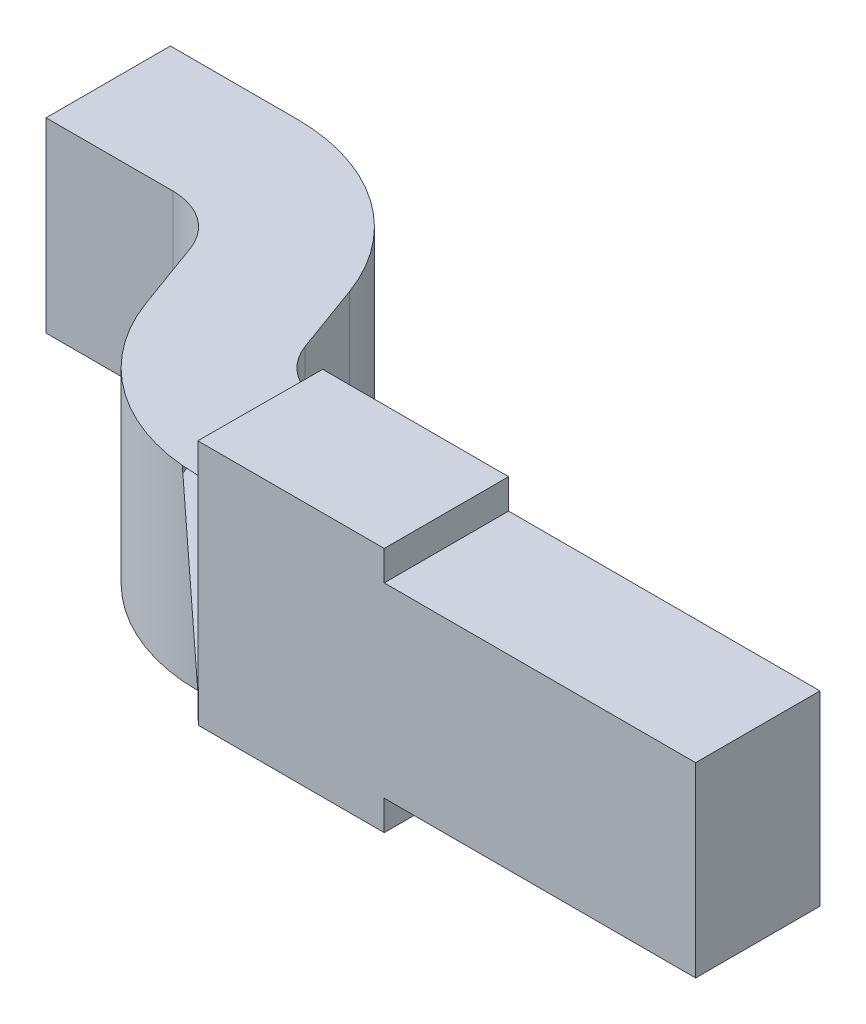
ISO-10303-21;
HEADER;
FILE_DESCRIPTION(('STEP AP214'),'2;1');
FILE_NAME('part.step','',(''),(''),'','','');
FILE_SCHEMA(('AUTOMOTIVE_DESIGN { 1 0 10303 214 1 1 1 1 }'));
ENDSEC;
DATA;
#1=APPLICATION_CONTEXT('core data for automotive mechanical design processes');
#2=APPLICATION_PROTOCOL_DEFINITION('international standard','automotive_design',2000,#1);
#3=PRODUCT_CONTEXT('',#1,'mechanical');
#4=PRODUCT('Part','Part','',(#3));
#5=PRODUCT_RELATED_PRODUCT_CATEGORY('part','',(#4));
#6=PRODUCT_DEFINITION_FORMATION('','',#4);
#7=PRODUCT_DEFINITION_CONTEXT('part definition',#1,'design');
#8=PRODUCT_DEFINITION('design','',#6,#7);
#9=PRODUCT_DEFINITION_SHAPE('','',#8);
#10=(LENGTH_UNIT() NAMED_UNIT(*) SI_UNIT(.MILLI.,.METRE.));
#11=(NAMED_UNIT(*) PLANE_ANGLE_UNIT() SI_UNIT($,.RADIAN.));
#12=(NAMED_UNIT(*) SI_UNIT($,.STERADIAN.) SOLID_ANGLE_UNIT());
#13=UNCERTAINTY_MEASURE_WITH_UNIT(LENGTH_MEASURE(1.E-05),#10,'distance_accuracy_value','');
#14=(GEOMETRIC_REPRESENTATION_CONTEXT(3) GLOBAL_UNCERTAINTY_ASSIGNED_CONTEXT((#13)) GLOBAL_UNIT_ASSIGNED_CONTEXT((#10,
#11,#12)) REPRESENTATION_CONTEXT('',''));
#15=CARTESIAN_POINT('',(0.,0.,0.));
#16=DIRECTION('',(0.,0.,1.));
#17=DIRECTION('',(1.,0.,0.));
#18=AXIS2_PLACEMENT_3D('',#15,#16,#17);
#19=CARTESIAN_POINT('',(195.3553175894,98.8770432923502,113.086328634145));
#20=DIRECTION('',(0.,1.,0.));
#21=DIRECTION('',(1.,0.,0.));
#22=AXIS2_PLACEMENT_3D('',#19,#20,#21);
#23=PLANE('',#22);
#24=DIRECTION('',(-1.,0.,0.));
#25=VECTOR('',#24,1.);
#26=CARTESIAN_POINT('',(197.209042943722,98.8770432923502,113.151470551509));
#27=LINE('',#26,#25);
#28=CARTESIAN_POINT('',(197.209042943722,98.8770432923502,113.151470551509));
#29=VERTEX_POINT('',#28);
#30=CARTESIAN_POINT('',(195.956744279938,98.8770432923502,113.151470551509));
#31=VERTEX_POINT('',#30);
#32=EDGE_CURVE('E67',#29,#31,#27,.T.);
#33=ORIENTED_EDGE('',*,*,#32,.F.);
#34=DIRECTION('',(0.,0.,-1.));
#35=VECTOR('',#34,1.);
#36=CARTESIAN_POINT('',(197.209042943722,98.8770432923502,113.651470551509));
#37=LINE('',#36,#35);
#38=CARTESIAN_POINT('',(197.209042943722,98.8770432923502,113.651470551509));
#39=VERTEX_POINT('',#38);
#40=EDGE_CURVE('E348',#39,#29,#37,.T.);
#41=ORIENTED_EDGE('',*,*,#40,.F.);
#42=DIRECTION('',(1.,0.,0.));
#43=VECTOR('',#42,1.);
#44=CARTESIAN_POINT('',(195.209042943722,98.8770432923502,113.651470551509));
#45=LINE('',#44,#43);
#46=CARTESIAN_POINT('',(195.956744279938,98.8770432923502,113.651470551509));
#47=VERTEX_POINT('',#46);
#48=EDGE_CURVE('E333',#47,#39,#45,.T.);
#49=ORIENTED_EDGE('',*,*,#48,.F.);
#50=DIRECTION('',(0.,0.,-1.));
#51=VECTOR('',#50,1.);
#52=CARTESIAN_POINT('',(195.956744279938,98.8770432923502,112.648955771372));
#53=LINE('',#52,#51);
#54=EDGE_CURVE('E11',#47,#31,#53,.T.);
#55=ORIENTED_EDGE('',*,*,#54,.T.);
#56=EDGE_LOOP('',(#33,#41,#49,#55));
#57=FACE_BOUND('',#56,.T.);
#58=ADVANCED_FACE('F44',(#57),#23,.F.);
#59=CARTESIAN_POINT('',(195.956744279938,104.78204329235,112.211582908599));
#60=DIRECTION('',(1.,0.,0.));
#61=DIRECTION('',(0.,1.,0.));
#62=AXIS2_PLACEMENT_3D('',#59,#60,#61);
#63=PLANE('',#62);
#64=ORIENTED_EDGE('',*,*,#54,.F.);
#65=DIRECTION('',(0.,1.,0.));
#66=VECTOR('',#65,1.);
#67=CARTESIAN_POINT('',(195.956744279938,102.26454329235,113.651470551509));
#68=LINE('',#67,#66);
#69=CARTESIAN_POINT('',(195.956744279938,98.7570432923502,113.651470551509));
#70=VERTEX_POINT('',#69);
#71=EDGE_CURVE('E218',#70,#47,#68,.T.);
#72=ORIENTED_EDGE('',*,*,#71,.F.);
#73=DIRECTION('',(0.,0.,-1.));
#74=VECTOR('',#73,1.);
#75=CARTESIAN_POINT('',(195.956744279938,98.7570432923502,112.648955771372));
#76=LINE('',#75,#74);
#77=CARTESIAN_POINT('',(195.956744279938,98.7570432923502,113.151470551509));
#78=VERTEX_POINT('',#77);
#79=EDGE_CURVE('E55',#70,#78,#76,.T.);
#80=ORIENTED_EDGE('',*,*,#79,.T.);
#81=DIRECTION('',(0.,-1.,0.));
#82=VECTOR('',#81,1.);
#83=CARTESIAN_POINT('',(195.956744279938,102.26454329235,113.151470551509));
#84=LINE('',#83,#82);
#85=EDGE_CURVE('E202',#31,#78,#84,.T.);
#86=ORIENTED_EDGE('',*,*,#85,.F.);
#87=EDGE_LOOP('',(#64,#72,#80,#86));
#88=FACE_BOUND('',#87,.T.);
#89=ADVANCED_FACE('F216',(#88),#63,.T.);
#90=CARTESIAN_POINT('',(195.3553175894,98.7570432923502,113.086328634145));
#91=DIRECTION('',(0.,1.,0.));
#92=DIRECTION('',(1.,0.,0.));
#93=AXIS2_PLACEMENT_3D('',#90,#91,#92);
#94=PLANE('',#93);
#95=DIRECTION('',(-1.,0.,0.));
#96=VECTOR('',#95,1.);
#97=CARTESIAN_POINT('',(197.209042943722,98.7570432923502,113.151470551509));
#98=LINE('',#97,#96);
#99=CARTESIAN_POINT('',(195.209042943722,98.7570432923502,113.151470551509));
#100=VERTEX_POINT('',#99);
#101=EDGE_CURVE('E208',#78,#100,#98,.T.);
#102=ORIENTED_EDGE('',*,*,#101,.F.);
#103=ORIENTED_EDGE('',*,*,#79,.F.);
#104=DIRECTION('',(1.,0.,0.));
#105=VECTOR('',#104,1.);
#106=CARTESIAN_POINT('',(195.209042943722,98.7570432923502,113.651470551509));
#107=LINE('',#106,#105);
#108=CARTESIAN_POINT('',(195.209042943722,98.7570432923502,113.651470551509));
#109=VERTEX_POINT('',#108);
#110=EDGE_CURVE('E405',#109,#70,#107,.T.);
#111=ORIENTED_EDGE('',*,*,#110,.F.);
#112=DIRECTION('',(0.,0.,1.));
#113=VECTOR('',#112,1.);
#114=CARTESIAN_POINT('',(195.206744279938,98.7570432923502,112.648955771372));
#115=LINE('',#114,#113);
#116=EDGE_CURVE('E222',#100,#109,#115,.T.);
#117=ORIENTED_EDGE('',*,*,#116,.F.);
#118=EDGE_LOOP('',(#102,#103,#111,#117));
#119=FACE_BOUND('',#118,.T.);
#120=ADVANCED_FACE('F224',(#119),#94,.F.);
#121=CARTESIAN_POINT('',(195.206744279938,98.2820432923502,112.211582908599));
#122=DIRECTION('',(-1.,0.,0.));
#123=DIRECTION('',(0.,0.,1.));
#124=AXIS2_PLACEMENT_3D('',#121,#122,#123);
#125=PLANE('',#124);
#126=DIRECTION('',(0.,1.,0.));
#127=VECTOR('',#126,1.);
#128=CARTESIAN_POINT('',(195.206744279938,99.7470432923502,113.151459983575));
#129=LINE('',#128,#127);
#130=CARTESIAN_POINT('',(195.206744279938,98.8770432923502,113.151459983575));
#131=VERTEX_POINT('',#130);
#132=EDGE_CURVE('E234',#100,#131,#129,.T.);
#133=ORIENTED_EDGE('',*,*,#132,.F.);
#134=ORIENTED_EDGE('',*,*,#116,.T.);
#135=DIRECTION('',(0.,1.,0.));
#136=VECTOR('',#135,1.);
#137=CARTESIAN_POINT('',(195.206744279938,99.7470432923502,113.651467028931));
#138=LINE('',#137,#136);
#139=CARTESIAN_POINT('',(195.206744279938,98.8770432923502,113.651467028931));
#140=VERTEX_POINT('',#139);
#141=EDGE_CURVE('E388',#109,#140,#138,.T.);
#142=ORIENTED_EDGE('',*,*,#141,.T.);
#143=DIRECTION('',(0.,0.,1.));
#144=VECTOR('',#143,1.);
#145=CARTESIAN_POINT('',(195.206744279938,98.8770432923502,112.648955771372));
#146=LINE('',#145,#144);
#147=EDGE_CURVE('E361',#131,#140,#146,.T.);
#148=ORIENTED_EDGE('',*,*,#147,.F.);
#149=EDGE_LOOP('',(#133,#134,#142,#148));
#150=FACE_BOUND('',#149,.T.);
#151=ADVANCED_FACE('F502',(#150),#125,.T.);
#152=CARTESIAN_POINT('',(195.3553175894,98.8770432923502,113.086328634145));
#153=DIRECTION('',(0.,1.,0.));
#154=DIRECTION('',(1.,0.,0.));
#155=AXIS2_PLACEMENT_3D('',#152,#153,#154);
#156=PLANE('',#155);
#157=DIRECTION('',(-1.,0.,0.));
#158=VECTOR('',#157,1.);
#159=CARTESIAN_POINT('',(194.166744279938,98.8770432923502,112.211582908599));
#160=LINE('',#159,#158);
#161=CARTESIAN_POINT('',(194.166744279938,98.8770432923502,112.211582908599));
#162=VERTEX_POINT('',#161);
#163=CARTESIAN_POINT('',(193.656744279938,98.8770432923502,112.211582908599));
#164=VERTEX_POINT('',#163);
#165=EDGE_CURVE('E308',#162,#164,#160,.T.);
#166=ORIENTED_EDGE('',*,*,#165,.F.);
#167=CARTESIAN_POINT('',(194.166744279938,98.8770432923502,112.961582908599));
#168=DIRECTION('',(0.,1.,0.));
#169=DIRECTION('',(0.939692620785816,0.,-0.342020143325922));
#170=AXIS2_PLACEMENT_3D('',#167,#168,#169);
#171=CIRCLE('',#170,0.75);
#172=CARTESIAN_POINT('',(194.871513745527,98.8770432923502,112.705067801105));
#173=VERTEX_POINT('',#172);
#174=EDGE_CURVE('E288',#173,#162,#171,.T.);
#175=ORIENTED_EDGE('',*,*,#174,.F.);
#176=DIRECTION('',(-0.342020143325932,0.,-0.939692620785813));
#177=VECTOR('',#176,1.);
#178=CARTESIAN_POINT('',(194.974119788525,98.8770432923502,112.986975587341));
#179=LINE('',#178,#177);
#180=CARTESIAN_POINT('',(194.974119788525,98.8770432923502,112.986975587341));
#181=VERTEX_POINT('',#180);
#182=EDGE_CURVE('E299',#181,#173,#179,.T.);
#183=ORIENTED_EDGE('',*,*,#182,.F.);
#184=CARTESIAN_POINT('',(195.209042943722,98.8770432923502,112.901470551509));
#185=DIRECTION('',(0.,-1.,0.));
#186=DIRECTION('',(0.,0.,1.));
#187=AXIS2_PLACEMENT_3D('',#184,#185,#186);
#188=CIRCLE('',#187,0.25);
#189=EDGE_CURVE('E270',#131,#181,#188,.T.);
#190=ORIENTED_EDGE('',*,*,#189,.F.);
#191=ORIENTED_EDGE('',*,*,#147,.T.);
#192=CARTESIAN_POINT('',(195.209042943722,98.8770432923502,112.901470551509));
#193=DIRECTION('',(0.,1.,0.));
#194=DIRECTION('',(-0.939692620785816,0.,0.342020143325922));
#195=AXIS2_PLACEMENT_3D('',#192,#193,#194);
#196=CIRCLE('',#195,0.75);
#197=CARTESIAN_POINT('',(194.504273478132,98.8770432923502,113.157985659003));
#198=VERTEX_POINT('',#197);
#199=EDGE_CURVE('E343',#198,#140,#196,.T.);
#200=ORIENTED_EDGE('',*,*,#199,.F.);
#201=DIRECTION('',(0.342020143325932,0.,0.939692620785813));
#202=VECTOR('',#201,1.);
#203=CARTESIAN_POINT('',(194.401667435134,98.8770432923502,112.876077872768));
#204=LINE('',#203,#202);
#205=CARTESIAN_POINT('',(194.401667435134,98.8770432923502,112.876077872768));
#206=VERTEX_POINT('',#205);
#207=EDGE_CURVE('E298',#206,#198,#204,.T.);
#208=ORIENTED_EDGE('',*,*,#207,.F.);
#209=CARTESIAN_POINT('',(194.166744279938,98.8770432923502,112.961582908599));
#210=DIRECTION('',(0.,-1.,0.));
#211=DIRECTION('',(0.,0.,-1.));
#212=AXIS2_PLACEMENT_3D('',#209,#210,#211);
#213=CIRCLE('',#212,0.25);
#214=CARTESIAN_POINT('',(194.166744279938,98.8770432923502,112.711582908599));
#215=VERTEX_POINT('',#214);
#216=EDGE_CURVE('E317',#215,#206,#213,.T.);
#217=ORIENTED_EDGE('',*,*,#216,.F.);
#218=DIRECTION('',(1.,0.,0.));
#219=VECTOR('',#218,1.);
#220=CARTESIAN_POINT('',(193.656744279938,98.8770432923502,112.711582908599));
#221=LINE('',#220,#219);
#222=CARTESIAN_POINT('',(193.656744279938,98.8770432923502,112.711582908599));
#223=VERTEX_POINT('',#222);
#224=EDGE_CURVE('E362',#223,#215,#221,.T.);
#225=ORIENTED_EDGE('',*,*,#224,.F.);
#226=DIRECTION('',(0.,0.,1.));
#227=VECTOR('',#226,1.);
#228=CARTESIAN_POINT('',(193.656744279938,98.8770432923502,112.211582908599));
#229=LINE('',#228,#227);
#230=EDGE_CURVE('E290',#164,#223,#229,.T.);
#231=ORIENTED_EDGE('',*,*,#230,.F.);
#232=EDGE_LOOP('',(#166,#175,#183,#190,#191,#200,#208,#217,#225,#231));
#233=FACE_BOUND('',#232,.T.);
#234=ADVANCED_FACE('F445',(#233),#156,.F.);
#235=CARTESIAN_POINT('',(193.656744279938,99.6270432923502,112.711582908599));
#236=DIRECTION('',(0.,0.,1.));
#237=DIRECTION('',(1.,0.,0.));
#238=AXIS2_PLACEMENT_3D('',#235,#236,#237);
#239=PLANE('',#238);
#240=DIRECTION('',(0.,-1.,0.));
#241=VECTOR('',#240,1.);
#242=CARTESIAN_POINT('',(193.656744279938,99.6270432923502,112.711582908599));
#243=LINE('',#242,#241);
#244=CARTESIAN_POINT('',(193.656744279938,99.6270432923502,112.711582908599));
#245=VERTEX_POINT('',#244);
#246=EDGE_CURVE('E357',#245,#223,#243,.T.);
#247=ORIENTED_EDGE('',*,*,#246,.T.);
#248=ORIENTED_EDGE('',*,*,#224,.T.);
#249=DIRECTION('',(0.,-1.,0.));
#250=VECTOR('',#249,1.);
#251=CARTESIAN_POINT('',(194.166744279938,99.6270432923502,112.711582908599));
#252=LINE('',#251,#250);
#253=CARTESIAN_POINT('',(194.166744279938,99.6270432923502,112.711582908599));
#254=VERTEX_POINT('',#253);
#255=EDGE_CURVE('E321',#254,#215,#252,.T.);
#256=ORIENTED_EDGE('',*,*,#255,.F.);
#257=DIRECTION('',(1.,0.,0.));
#258=VECTOR('',#257,1.);
#259=CARTESIAN_POINT('',(193.656744279938,99.6270432923502,112.711582908599));
#260=LINE('',#259,#258);
#261=EDGE_CURVE('E349',#245,#254,#260,.T.);
#262=ORIENTED_EDGE('',*,*,#261,.F.);
#263=EDGE_LOOP('',(#247,#248,#256,#262));
#264=FACE_BOUND('',#263,.T.);
#265=ADVANCED_FACE('F453',(#264),#239,.T.);
#266=CARTESIAN_POINT('',(194.166744279938,99.6270432923502,112.961582908599));
#267=DIRECTION('',(0.,1.,0.));
#268=DIRECTION('',(0.,0.,-1.));
#269=AXIS2_PLACEMENT_3D('',#266,#267,#268);
#270=CYLINDRICAL_SURFACE('',#269,0.25);
#271=ORIENTED_EDGE('',*,*,#255,.T.);
#272=ORIENTED_EDGE('',*,*,#216,.T.);
#273=DIRECTION('',(0.,-1.,0.));
#274=VECTOR('',#273,1.);
#275=CARTESIAN_POINT('',(194.401667435134,99.6270432923502,112.876077872768));
#276=LINE('',#275,#274);
#277=CARTESIAN_POINT('',(194.401667435134,99.6270432923502,112.876077872768));
#278=VERTEX_POINT('',#277);
#279=EDGE_CURVE('E322',#278,#206,#276,.T.);
#280=ORIENTED_EDGE('',*,*,#279,.F.);
#281=CARTESIAN_POINT('',(194.166744279938,99.6270432923502,112.961582908599));
#282=DIRECTION('',(0.,-1.,0.));
#283=DIRECTION('',(0.,0.,-1.));
#284=AXIS2_PLACEMENT_3D('',#281,#282,#283);
#285=CIRCLE('',#284,0.25);
#286=EDGE_CURVE('E356',#254,#278,#285,.T.);
#287=ORIENTED_EDGE('',*,*,#286,.F.);
#288=EDGE_LOOP('',(#271,#272,#280,#287));
#289=FACE_BOUND('',#288,.T.);
#290=ADVANCED_FACE('F448',(#289),#270,.F.);
#291=CARTESIAN_POINT('',(194.401667435134,99.6270432923502,112.876077872768));
#292=DIRECTION('',(-0.939692620785813,0.,0.342020143325932));
#293=DIRECTION('',(0.,1.,0.));
#294=AXIS2_PLACEMENT_3D('',#291,#292,#293);
#295=PLANE('',#294);
#296=ORIENTED_EDGE('',*,*,#279,.T.);
#297=ORIENTED_EDGE('',*,*,#207,.T.);
#298=DIRECTION('',(0.,-1.,0.));
#299=VECTOR('',#298,1.);
#300=CARTESIAN_POINT('',(194.504273478132,99.6270432923502,113.157985659003));
#301=LINE('',#300,#299);
#302=CARTESIAN_POINT('',(194.504273478132,99.6270432923502,113.157985659003));
#303=VERTEX_POINT('',#302);
#304=EDGE_CURVE('E256',#303,#198,#301,.T.);
#305=ORIENTED_EDGE('',*,*,#304,.F.);
#306=DIRECTION('',(0.342020143325932,0.,0.939692620785813));
#307=VECTOR('',#306,1.);
#308=CARTESIAN_POINT('',(194.401667435134,99.6270432923502,112.876077872768));
#309=LINE('',#308,#307);
#310=EDGE_CURVE('E338',#278,#303,#309,.T.);
#311=ORIENTED_EDGE('',*,*,#310,.F.);
#312=EDGE_LOOP('',(#296,#297,#305,#311));
#313=FACE_BOUND('',#312,.T.);
#314=ADVANCED_FACE('F442',(#313),#295,.T.);
#315=CARTESIAN_POINT('',(194.974119788525,99.6270432923502,112.986975587341));
#316=DIRECTION('',(0.939692620785813,0.,-0.342020143325932));
#317=DIRECTION('',(0.,-1.,0.));
#318=AXIS2_PLACEMENT_3D('',#315,#316,#317);
#319=PLANE('',#318);
#320=DIRECTION('',(0.,-1.,0.));
#321=VECTOR('',#320,1.);
#322=CARTESIAN_POINT('',(194.974119788525,99.6270432923502,112.986975587341));
#323=LINE('',#322,#321);
#324=CARTESIAN_POINT('',(194.974119788525,99.6270432923502,112.986975587341));
#325=VERTEX_POINT('',#324);
#326=EDGE_CURVE('E294',#325,#181,#323,.T.);
#327=ORIENTED_EDGE('',*,*,#326,.T.);
#328=ORIENTED_EDGE('',*,*,#182,.T.);
#329=DIRECTION('',(0.,-1.,0.));
#330=VECTOR('',#329,1.);
#331=CARTESIAN_POINT('',(194.871513745527,99.6270432923502,112.705067801105));
#332=LINE('',#331,#330);
#333=CARTESIAN_POINT('',(194.871513745527,99.6270432923502,112.705067801105));
#334=VERTEX_POINT('',#333);
#335=EDGE_CURVE('E326',#334,#173,#332,.T.);
#336=ORIENTED_EDGE('',*,*,#335,.F.);
#337=DIRECTION('',(-0.342020143325932,0.,-0.939692620785813));
#338=VECTOR('',#337,1.);
#339=CARTESIAN_POINT('',(194.974119788525,99.6270432923502,112.986975587341));
#340=LINE('',#339,#338);
#341=EDGE_CURVE('E303',#325,#334,#340,.T.);
#342=ORIENTED_EDGE('',*,*,#341,.F.);
#343=EDGE_LOOP('',(#327,#328,#336,#342));
#344=FACE_BOUND('',#343,.T.);
#345=ADVANCED_FACE('F505',(#344),#319,.T.);
#346=CARTESIAN_POINT('',(194.166744279938,99.6270432923502,112.961582908599));
#347=DIRECTION('',(0.,1.,0.));
#348=DIRECTION('',(0.939692620785816,0.,-0.342020143325922));
#349=AXIS2_PLACEMENT_3D('',#346,#347,#348);
#350=CYLINDRICAL_SURFACE('',#349,0.75);
#351=ORIENTED_EDGE('',*,*,#335,.T.);
#352=ORIENTED_EDGE('',*,*,#174,.T.);
#353=DIRECTION('',(0.,-1.,0.));
#354=VECTOR('',#353,1.);
#355=CARTESIAN_POINT('',(194.166744279938,99.6270432923502,112.211582908599));
#356=LINE('',#355,#354);
#357=CARTESIAN_POINT('',(194.166744279938,99.6270432923502,112.211582908599));
#358=VERTEX_POINT('',#357);
#359=EDGE_CURVE('E312',#358,#162,#356,.T.);
#360=ORIENTED_EDGE('',*,*,#359,.F.);
#361=CARTESIAN_POINT('',(194.166744279938,99.6270432923502,112.961582908599));
#362=DIRECTION('',(0.,1.,0.));
#363=DIRECTION('',(0.939692620785816,0.,-0.342020143325922));
#364=AXIS2_PLACEMENT_3D('',#361,#362,#363);
#365=CIRCLE('',#364,0.75);
#366=EDGE_CURVE('E300',#334,#358,#365,.T.);
#367=ORIENTED_EDGE('',*,*,#366,.F.);
#368=EDGE_LOOP('',(#351,#352,#360,#367));
#369=FACE_BOUND('',#368,.T.);
#370=ADVANCED_FACE('F506',(#369),#350,.T.);
#371=CARTESIAN_POINT('',(194.166744279938,99.6270432923502,112.211582908599));
#372=DIRECTION('',(0.,0.,-1.));
#373=DIRECTION('',(0.,-1.,0.));
#374=AXIS2_PLACEMENT_3D('',#371,#372,#373);
#375=PLANE('',#374);
#376=ORIENTED_EDGE('',*,*,#359,.T.);
#377=ORIENTED_EDGE('',*,*,#165,.T.);
#378=DIRECTION('',(0.,-1.,0.));
#379=VECTOR('',#378,1.);
#380=CARTESIAN_POINT('',(193.656744279938,99.6270432923502,112.211582908599));
#381=LINE('',#380,#379);
#382=CARTESIAN_POINT('',(193.656744279938,99.6270432923502,112.211582908599));
#383=VERTEX_POINT('',#382);
#384=EDGE_CURVE('E292',#383,#164,#381,.T.);
#385=ORIENTED_EDGE('',*,*,#384,.F.);
#386=DIRECTION('',(-1.,0.,0.));
#387=VECTOR('',#386,1.);
#388=CARTESIAN_POINT('',(194.166744279938,99.6270432923502,112.211582908599));
#389=LINE('',#388,#387);
#390=EDGE_CURVE('E304',#358,#383,#389,.T.);
#391=ORIENTED_EDGE('',*,*,#390,.F.);
#392=EDGE_LOOP('',(#376,#377,#385,#391));
#393=FACE_BOUND('',#392,.T.);
#394=ADVANCED_FACE('F467',(#393),#375,.T.);
#395=CARTESIAN_POINT('',(193.656744279938,99.6270432923502,112.211582908599));
#396=DIRECTION('',(-1.,0.,0.));
#397=DIRECTION('',(0.,1.,0.));
#398=AXIS2_PLACEMENT_3D('',#395,#396,#397);
#399=PLANE('',#398);
#400=ORIENTED_EDGE('',*,*,#384,.T.);
#401=ORIENTED_EDGE('',*,*,#230,.T.);
#402=ORIENTED_EDGE('',*,*,#246,.F.);
#403=DIRECTION('',(0.,0.,1.));
#404=VECTOR('',#403,1.);
#405=CARTESIAN_POINT('',(193.656744279938,99.6270432923502,112.211582908599));
#406=LINE('',#405,#404);
#407=EDGE_CURVE('E344',#383,#245,#406,.T.);
#408=ORIENTED_EDGE('',*,*,#407,.F.);
#409=EDGE_LOOP('',(#400,#401,#402,#408));
#410=FACE_BOUND('',#409,.T.);
#411=ADVANCED_FACE('F462',(#410),#399,.T.);
#412=CARTESIAN_POINT('',(197.209042943722,99.6270432923502,113.651470551509));
#413=DIRECTION('',(1.,0.,0.));
#414=DIRECTION('',(0.,1.,0.));
#415=AXIS2_PLACEMENT_3D('',#412,#413,#414);
#416=PLANE('',#415);
#417=DIRECTION('',(0.,-1.,0.));
#418=VECTOR('',#417,1.);
#419=CARTESIAN_POINT('',(197.209042943722,99.6270432923502,113.651470551509));
#420=LINE('',#419,#418);
#421=CARTESIAN_POINT('',(197.209042943722,99.6270432923502,113.651470551509));
#422=VERTEX_POINT('',#421);
#423=EDGE_CURVE('E293',#422,#39,#420,.T.);
#424=ORIENTED_EDGE('',*,*,#423,.T.);
#425=ORIENTED_EDGE('',*,*,#40,.T.);
#426=DIRECTION('',(0.,-1.,0.));
#427=VECTOR('',#426,1.);
#428=CARTESIAN_POINT('',(197.209042943722,99.6270432923502,113.151470551509));
#429=LINE('',#428,#427);
#430=CARTESIAN_POINT('',(197.209042943722,99.6270432923502,113.151470551509));
#431=VERTEX_POINT('',#430);
#432=EDGE_CURVE('E307',#431,#29,#429,.T.);
#433=ORIENTED_EDGE('',*,*,#432,.F.);
#434=DIRECTION('',(0.,0.,-1.));
#435=VECTOR('',#434,1.);
#436=CARTESIAN_POINT('',(197.209042943722,99.6270432923502,113.651470551509));
#437=LINE('',#436,#435);
#438=EDGE_CURVE('E478',#422,#431,#437,.T.);
#439=ORIENTED_EDGE('',*,*,#438,.F.);
#440=EDGE_LOOP('',(#424,#425,#433,#439));
#441=FACE_BOUND('',#440,.T.);
#442=ADVANCED_FACE('F546',(#441),#416,.T.);
#443=CARTESIAN_POINT('',(195.3553175894,99.6270432923502,113.086328634145));
#444=DIRECTION('',(0.,1.,0.));
#445=DIRECTION('',(1.,0.,0.));
#446=AXIS2_PLACEMENT_3D('',#443,#444,#445);
#447=PLANE('',#446);
#448=ORIENTED_EDGE('',*,*,#407,.T.);
#449=ORIENTED_EDGE('',*,*,#261,.T.);
#450=ORIENTED_EDGE('',*,*,#286,.T.);
#451=ORIENTED_EDGE('',*,*,#310,.T.);
#452=CARTESIAN_POINT('',(195.209042943722,99.6270432923502,112.901470551509));
#453=DIRECTION('',(0.,1.,0.));
#454=DIRECTION('',(-0.939692620785816,0.,0.342020143325922));
#455=AXIS2_PLACEMENT_3D('',#452,#453,#454);
#456=CIRCLE('',#455,0.75);
#457=CARTESIAN_POINT('',(195.206744279938,99.6270432923502,113.651467028931));
#458=VERTEX_POINT('',#457);
#459=EDGE_CURVE('E335',#303,#458,#456,.T.);
#460=ORIENTED_EDGE('',*,*,#459,.T.);
#461=DIRECTION('',(0.,0.,1.));
#462=VECTOR('',#461,1.);
#463=CARTESIAN_POINT('',(195.206744279938,99.6270432923502,112.648955771372));
#464=LINE('',#463,#462);
#465=CARTESIAN_POINT('',(195.206744279938,99.6270432923502,113.151459983575));
#466=VERTEX_POINT('',#465);
#467=EDGE_CURVE('E255',#466,#458,#464,.T.);
#468=ORIENTED_EDGE('',*,*,#467,.F.);
#469=CARTESIAN_POINT('',(195.209042943722,99.6270432923502,112.901470551509));
#470=DIRECTION('',(0.,-1.,0.));
#471=DIRECTION('',(0.,0.,1.));
#472=AXIS2_PLACEMENT_3D('',#469,#470,#471);
#473=CIRCLE('',#472,0.25);
#474=EDGE_CURVE('E339',#466,#325,#473,.T.);
#475=ORIENTED_EDGE('',*,*,#474,.T.);
#476=ORIENTED_EDGE('',*,*,#341,.T.);
#477=ORIENTED_EDGE('',*,*,#366,.T.);
#478=ORIENTED_EDGE('',*,*,#390,.T.);
#479=EDGE_LOOP('',(#448,#449,#450,#451,#460,#468,#475,#476,#477,#478));
#480=FACE_BOUND('',#479,.T.);
#481=ADVANCED_FACE('F46',(#480),#447,.T.);
#482=CARTESIAN_POINT('',(195.3553175894,99.6270432923502,113.086328634145));
#483=DIRECTION('',(0.,1.,0.));
#484=DIRECTION('',(1.,0.,0.));
#485=AXIS2_PLACEMENT_3D('',#482,#483,#484);
#486=PLANE('',#485);
#487=DIRECTION('',(0.,0.,-1.));
#488=VECTOR('',#487,1.);
#489=CARTESIAN_POINT('',(195.956744279938,99.6270432923502,112.648955771372));
#490=LINE('',#489,#488);
#491=CARTESIAN_POINT('',(195.956744279938,99.6270432923502,113.651470551509));
#492=VERTEX_POINT('',#491);
#493=CARTESIAN_POINT('',(195.956744279938,99.6270432923502,113.151470551509));
#494=VERTEX_POINT('',#493);
#495=EDGE_CURVE('E334',#492,#494,#490,.T.);
#496=ORIENTED_EDGE('',*,*,#495,.F.);
#497=DIRECTION('',(1.,0.,0.));
#498=VECTOR('',#497,1.);
#499=CARTESIAN_POINT('',(195.209042943722,99.6270432923502,113.651470551509));
#500=LINE('',#499,#498);
#501=EDGE_CURVE('E316',#492,#422,#500,.T.);
#502=ORIENTED_EDGE('',*,*,#501,.T.);
#503=ORIENTED_EDGE('',*,*,#438,.T.);
#504=DIRECTION('',(-1.,0.,0.));
#505=VECTOR('',#504,1.);
#506=CARTESIAN_POINT('',(197.209042943722,99.6270432923502,113.151470551509));
#507=LINE('',#506,#505);
#508=EDGE_CURVE('E438',#431,#494,#507,.T.);
#509=ORIENTED_EDGE('',*,*,#508,.T.);
#510=EDGE_LOOP('',(#496,#502,#503,#509));
#511=FACE_BOUND('',#510,.T.);
#512=ADVANCED_FACE('F488',(#511),#486,.T.);
#513=CARTESIAN_POINT('',(195.206744279938,98.2820432923502,112.211582908599));
#514=DIRECTION('',(-1.,0.,0.));
#515=DIRECTION('',(0.,0.,1.));
#516=AXIS2_PLACEMENT_3D('',#513,#514,#515);
#517=PLANE('',#516);
#518=DIRECTION('',(0.,1.,0.));
#519=VECTOR('',#518,1.);
#520=CARTESIAN_POINT('',(195.206744279938,99.7470432923502,113.151459983575));
#521=LINE('',#520,#519);
#522=CARTESIAN_POINT('',(195.209042943722,99.7470432923502,113.151470551509));
#523=VERTEX_POINT('',#522);
#524=EDGE_CURVE('E247',#466,#523,#521,.T.);
#525=ORIENTED_EDGE('',*,*,#524,.F.);
#526=ORIENTED_EDGE('',*,*,#467,.T.);
#527=DIRECTION('',(0.,1.,0.));
#528=VECTOR('',#527,1.);
#529=CARTESIAN_POINT('',(195.206744279938,99.7470432923502,113.651467028931));
#530=LINE('',#529,#528);
#531=CARTESIAN_POINT('',(195.206744279938,99.7470432923502,113.651467028931));
#532=VERTEX_POINT('',#531);
#533=EDGE_CURVE('E251',#458,#532,#530,.T.);
#534=ORIENTED_EDGE('',*,*,#533,.T.);
#535=DIRECTION('',(0.,0.,1.));
#536=VECTOR('',#535,1.);
#537=CARTESIAN_POINT('',(195.206744279938,99.7470432923502,112.648955771372));
#538=LINE('',#537,#536);
#539=EDGE_CURVE('E244',#523,#532,#538,.T.);
#540=ORIENTED_EDGE('',*,*,#539,.F.);
#541=EDGE_LOOP('',(#525,#526,#534,#540));
#542=FACE_BOUND('',#541,.T.);
#543=ADVANCED_FACE('F435',(#542),#517,.T.);
#544=CARTESIAN_POINT('',(195.209042943722,99.7470432923502,112.901470551509));
#545=DIRECTION('',(0.,1.,0.));
#546=DIRECTION('',(-0.939692620785816,0.,0.342020143325922));
#547=AXIS2_PLACEMENT_3D('',#544,#545,#546);
#548=CYLINDRICAL_SURFACE('',#547,0.75);
#549=DIRECTION('',(0.,-1.,0.));
#550=VECTOR('',#549,1.);
#551=CARTESIAN_POINT('',(195.209042943722,99.7470432923502,113.651470551509));
#552=LINE('',#551,#550);
#553=EDGE_CURVE('E374',#532,#109,#552,.T.);
#554=ORIENTED_EDGE('',*,*,#553,.F.);
#555=ORIENTED_EDGE('',*,*,#533,.F.);
#556=ORIENTED_EDGE('',*,*,#459,.F.);
#557=ORIENTED_EDGE('',*,*,#304,.T.);
#558=ORIENTED_EDGE('',*,*,#199,.T.);
#559=ORIENTED_EDGE('',*,*,#141,.F.);
#560=EDGE_LOOP('',(#554,#555,#556,#557,#558,#559));
#561=FACE_BOUND('',#560,.T.);
#562=ADVANCED_FACE('F431',(#561),#548,.T.);
#563=CARTESIAN_POINT('',(195.209042943722,99.7470432923502,113.651470551509));
#564=DIRECTION('',(0.,0.,1.));
#565=DIRECTION('',(1.,0.,0.));
#566=AXIS2_PLACEMENT_3D('',#563,#564,#565);
#567=PLANE('',#566);
#568=DIRECTION('',(1.,0.,0.));
#569=VECTOR('',#568,1.);
#570=CARTESIAN_POINT('',(195.209042943722,99.7470432923502,113.651470551509));
#571=LINE('',#570,#569);
#572=CARTESIAN_POINT('',(195.956744279938,99.7470432923502,113.651470551509));
#573=VERTEX_POINT('',#572);
#574=EDGE_CURVE('E248',#532,#573,#571,.T.);
#575=ORIENTED_EDGE('',*,*,#574,.F.);
#576=ORIENTED_EDGE('',*,*,#553,.T.);
#577=ORIENTED_EDGE('',*,*,#110,.T.);
#578=ORIENTED_EDGE('',*,*,#71,.T.);
#579=ORIENTED_EDGE('',*,*,#48,.T.);
#580=ORIENTED_EDGE('',*,*,#423,.F.);
#581=ORIENTED_EDGE('',*,*,#501,.F.);
#582=DIRECTION('',(0.,1.,0.));
#583=VECTOR('',#582,1.);
#584=CARTESIAN_POINT('',(195.956744279938,102.26454329235,113.651470551509));
#585=LINE('',#584,#583);
#586=EDGE_CURVE('E330',#492,#573,#585,.T.);
#587=ORIENTED_EDGE('',*,*,#586,.T.);
#588=EDGE_LOOP('',(#575,#576,#577,#578,#579,#580,#581,#587));
#589=FACE_BOUND('',#588,.T.);
#590=ADVANCED_FACE('F427',(#589),#567,.T.);
#591=CARTESIAN_POINT('',(195.956744279938,104.78204329235,112.211582908599));
#592=DIRECTION('',(1.,0.,0.));
#593=DIRECTION('',(0.,1.,0.));
#594=AXIS2_PLACEMENT_3D('',#591,#592,#593);
#595=PLANE('',#594);
#596=DIRECTION('',(0.,0.,-1.));
#597=VECTOR('',#596,1.);
#598=CARTESIAN_POINT('',(195.956744279938,99.7470432923502,112.648955771372));
#599=LINE('',#598,#597);
#600=CARTESIAN_POINT('',(195.956744279938,99.7470432923502,113.151470551509));
#601=VERTEX_POINT('',#600);
#602=EDGE_CURVE('E261',#573,#601,#599,.T.);
#603=ORIENTED_EDGE('',*,*,#602,.F.);
#604=ORIENTED_EDGE('',*,*,#586,.F.);
#605=ORIENTED_EDGE('',*,*,#495,.T.);
#606=DIRECTION('',(0.,-1.,0.));
#607=VECTOR('',#606,1.);
#608=CARTESIAN_POINT('',(195.956744279938,102.26454329235,113.151470551509));
#609=LINE('',#608,#607);
#610=EDGE_CURVE('E377',#601,#494,#609,.T.);
#611=ORIENTED_EDGE('',*,*,#610,.F.);
#612=EDGE_LOOP('',(#603,#604,#605,#611));
#613=FACE_BOUND('',#612,.T.);
#614=ADVANCED_FACE('F495',(#613),#595,.T.);
#615=CARTESIAN_POINT('',(197.209042943722,99.7470432923502,113.151470551509));
#616=DIRECTION('',(0.,0.,-1.));
#617=DIRECTION('',(-1.,0.,0.));
#618=AXIS2_PLACEMENT_3D('',#615,#616,#617);
#619=PLANE('',#618);
#620=DIRECTION('',(-1.,0.,0.));
#621=VECTOR('',#620,1.);
#622=CARTESIAN_POINT('',(197.209042943722,99.7470432923502,113.151470551509));
#623=LINE('',#622,#621);
#624=EDGE_CURVE('E264',#601,#523,#623,.T.);
#625=ORIENTED_EDGE('',*,*,#624,.F.);
#626=ORIENTED_EDGE('',*,*,#610,.T.);
#627=ORIENTED_EDGE('',*,*,#508,.F.);
#628=ORIENTED_EDGE('',*,*,#432,.T.);
#629=ORIENTED_EDGE('',*,*,#32,.T.);
#630=ORIENTED_EDGE('',*,*,#85,.T.);
#631=ORIENTED_EDGE('',*,*,#101,.T.);
#632=DIRECTION('',(0.,-1.,0.));
#633=VECTOR('',#632,1.);
#634=CARTESIAN_POINT('',(195.209042943722,99.7470432923502,113.151470551509));
#635=LINE('',#634,#633);
#636=EDGE_CURVE('E228',#523,#100,#635,.T.);
#637=ORIENTED_EDGE('',*,*,#636,.F.);
#638=EDGE_LOOP('',(#625,#626,#627,#628,#629,#630,#631,#637));
#639=FACE_BOUND('',#638,.T.);
#640=ADVANCED_FACE('F205',(#639),#619,.T.);
#641=CARTESIAN_POINT('',(195.209042943722,99.7470432923502,112.901470551509));
#642=DIRECTION('',(0.,1.,0.));
#643=DIRECTION('',(0.,0.,1.));
#644=AXIS2_PLACEMENT_3D('',#641,#642,#643);
#645=CYLINDRICAL_SURFACE('',#644,0.25);
#646=ORIENTED_EDGE('',*,*,#636,.T.);
#647=ORIENTED_EDGE('',*,*,#132,.T.);
#648=ORIENTED_EDGE('',*,*,#189,.T.);
#649=ORIENTED_EDGE('',*,*,#326,.F.);
#650=ORIENTED_EDGE('',*,*,#474,.F.);
#651=ORIENTED_EDGE('',*,*,#524,.T.);
#652=EDGE_LOOP('',(#646,#647,#648,#649,#650,#651));
#653=FACE_BOUND('',#652,.T.);
#654=ADVANCED_FACE('F499',(#653),#645,.F.);
#655=CARTESIAN_POINT('',(195.3553175894,99.7470432923502,113.086328634145));
#656=DIRECTION('',(0.,1.,0.));
#657=DIRECTION('',(1.,0.,0.));
#658=AXIS2_PLACEMENT_3D('',#655,#656,#657);
#659=PLANE('',#658);
#660=ORIENTED_EDGE('',*,*,#539,.T.);
#661=ORIENTED_EDGE('',*,*,#574,.T.);
#662=ORIENTED_EDGE('',*,*,#602,.T.);
#663=ORIENTED_EDGE('',*,*,#624,.T.);
#664=EDGE_LOOP('',(#660,#661,#662,#663));
#665=FACE_BOUND('',#664,.T.);
#666=ADVANCED_FACE('F498',(#665),#659,.T.);
#667=CLOSED_SHELL('',(#58,#89,#120,#151,#234,#265,#290,#314,#345,#370,#394,#411,#442,#481,#512,
#543,#562,#590,#614,#640,#654,#666));
#668=MANIFOLD_SOLID_BREP('B2',#667);
#669=ADVANCED_BREP_SHAPE_REPRESENTATION('',(#18,#668),#14);
#670=SHAPE_DEFINITION_REPRESENTATION(#9,#669);
ENDSEC;
END-ISO-10303-21;
